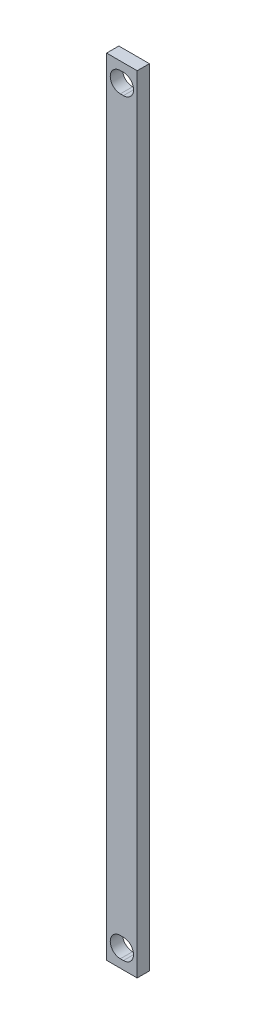
ISO-10303-21;
HEADER;
FILE_DESCRIPTION(('STEP AP214'),'2;1');
FILE_NAME('part.step','',(''),(''),'','','');
FILE_SCHEMA(('AUTOMOTIVE_DESIGN { 1 0 10303 214 1 1 1 1 }'));
ENDSEC;
DATA;
#1=APPLICATION_CONTEXT('core data for automotive mechanical design processes');
#2=APPLICATION_PROTOCOL_DEFINITION('international standard','automotive_design',2000,#1);
#3=PRODUCT_CONTEXT('',#1,'mechanical');
#4=PRODUCT('Part','Part','',(#3));
#5=PRODUCT_RELATED_PRODUCT_CATEGORY('part','',(#4));
#6=PRODUCT_DEFINITION_FORMATION('','',#4);
#7=PRODUCT_DEFINITION_CONTEXT('part definition',#1,'design');
#8=PRODUCT_DEFINITION('design','',#6,#7);
#9=PRODUCT_DEFINITION_SHAPE('','',#8);
#10=(LENGTH_UNIT() NAMED_UNIT(*) SI_UNIT(.MILLI.,.METRE.));
#11=(NAMED_UNIT(*) PLANE_ANGLE_UNIT() SI_UNIT($,.RADIAN.));
#12=(NAMED_UNIT(*) SI_UNIT($,.STERADIAN.) SOLID_ANGLE_UNIT());
#13=UNCERTAINTY_MEASURE_WITH_UNIT(LENGTH_MEASURE(1.E-05),#10,'distance_accuracy_value','');
#14=(GEOMETRIC_REPRESENTATION_CONTEXT(3) GLOBAL_UNCERTAINTY_ASSIGNED_CONTEXT((#13)) GLOBAL_UNIT_ASSIGNED_CONTEXT((#10,
#11,#12)) REPRESENTATION_CONTEXT('',''));
#15=CARTESIAN_POINT('',(0.,0.,0.));
#16=DIRECTION('',(0.,0.,1.));
#17=DIRECTION('',(1.,0.,0.));
#18=AXIS2_PLACEMENT_3D('',#15,#16,#17);
#19=CARTESIAN_POINT('',(0.,0.,2.));
#20=DIRECTION('',(0.,0.,1.));
#21=DIRECTION('',(1.,0.,0.));
#22=AXIS2_PLACEMENT_3D('',#19,#20,#21);
#23=PLANE('',#22);
#24=DIRECTION('',(0.,1.,0.));
#25=VECTOR('',#24,1.);
#26=CARTESIAN_POINT('',(2.49999999999999,64.25,2.));
#27=LINE('',#26,#25);
#28=CARTESIAN_POINT('',(2.50000000000001,-64.25,2.));
#29=VERTEX_POINT('',#28);
#30=CARTESIAN_POINT('',(2.49999999999999,64.25,2.));
#31=VERTEX_POINT('',#30);
#32=EDGE_CURVE('E199',#29,#31,#27,.T.);
#33=ORIENTED_EDGE('',*,*,#32,.T.);
#34=DIRECTION('',(-1.,0.,0.));
#35=VECTOR('',#34,1.);
#36=CARTESIAN_POINT('',(-2.50000000000001,64.25,2.));
#37=LINE('',#36,#35);
#38=CARTESIAN_POINT('',(-2.50000000000001,64.25,2.));
#39=VERTEX_POINT('',#38);
#40=EDGE_CURVE('E202',#31,#39,#37,.T.);
#41=ORIENTED_EDGE('',*,*,#40,.T.);
#42=DIRECTION('',(0.,-1.,0.));
#43=VECTOR('',#42,1.);
#44=CARTESIAN_POINT('',(-2.50000000000001,64.25,2.));
#45=LINE('',#44,#43);
#46=CARTESIAN_POINT('',(-2.49999999999999,-64.25,2.));
#47=VERTEX_POINT('',#46);
#48=EDGE_CURVE('E205',#39,#47,#45,.T.);
#49=ORIENTED_EDGE('',*,*,#48,.T.);
#50=DIRECTION('',(1.,0.,0.));
#51=VECTOR('',#50,1.);
#52=CARTESIAN_POINT('',(-2.49999999999999,-64.25,2.));
#53=LINE('',#52,#51);
#54=EDGE_CURVE('E207',#47,#29,#53,.T.);
#55=ORIENTED_EDGE('',*,*,#54,.T.);
#56=EDGE_LOOP('',(#33,#41,#49,#55));
#57=FACE_BOUND('',#56,.T.);
#58=DIRECTION('',(1.,0.,0.));
#59=VECTOR('',#58,1.);
#60=CARTESIAN_POINT('',(-0.253999999999985,-62.9,2.));
#61=LINE('',#60,#59);
#62=CARTESIAN_POINT('',(-0.253999999999985,-62.9,2.));
#63=VERTEX_POINT('',#62);
#64=CARTESIAN_POINT('',(0.254000000000016,-62.9,2.));
#65=VERTEX_POINT('',#64);
#66=EDGE_CURVE('E170',#63,#65,#61,.T.);
#67=ORIENTED_EDGE('',*,*,#66,.F.);
#68=CARTESIAN_POINT('',(-0.253999999999984,-61.25,2.));
#69=DIRECTION('',(0.,0.,1.));
#70=DIRECTION('',(1.,0.,0.));
#71=AXIS2_PLACEMENT_3D('',#68,#69,#70);
#72=CIRCLE('',#71,1.65);
#73=CARTESIAN_POINT('',(-0.253999999999985,-59.6,2.));
#74=VERTEX_POINT('',#73);
#75=EDGE_CURVE('E168',#74,#63,#72,.T.);
#76=ORIENTED_EDGE('',*,*,#75,.F.);
#77=DIRECTION('',(-1.,0.,0.));
#78=VECTOR('',#77,1.);
#79=CARTESIAN_POINT('',(-0.253999999999985,-59.6,2.));
#80=LINE('',#79,#78);
#81=CARTESIAN_POINT('',(0.254000000000015,-59.6,2.));
#82=VERTEX_POINT('',#81);
#83=EDGE_CURVE('E176',#82,#74,#80,.T.);
#84=ORIENTED_EDGE('',*,*,#83,.F.);
#85=CARTESIAN_POINT('',(0.254000000000015,-61.25,2.));
#86=DIRECTION('',(0.,0.,1.));
#87=DIRECTION('',(1.,0.,0.));
#88=AXIS2_PLACEMENT_3D('',#85,#86,#87);
#89=CIRCLE('',#88,1.65);
#90=EDGE_CURVE('E173',#65,#82,#89,.T.);
#91=ORIENTED_EDGE('',*,*,#90,.F.);
#92=EDGE_LOOP('',(#67,#76,#84,#91));
#93=FACE_BOUND('',#92,.T.);
#94=DIRECTION('',(1.,0.,0.));
#95=VECTOR('',#94,1.);
#96=CARTESIAN_POINT('',(-0.253999999999999,59.6,2.));
#97=LINE('',#96,#95);
#98=CARTESIAN_POINT('',(-0.253999999999999,59.6,2.));
#99=VERTEX_POINT('',#98);
#100=CARTESIAN_POINT('',(0.254,59.6,2.));
#101=VERTEX_POINT('',#100);
#102=EDGE_CURVE('E140',#99,#101,#97,.T.);
#103=ORIENTED_EDGE('',*,*,#102,.F.);
#104=CARTESIAN_POINT('',(-0.254,61.25,2.));
#105=DIRECTION('',(0.,0.,1.));
#106=DIRECTION('',(1.,0.,0.));
#107=AXIS2_PLACEMENT_3D('',#104,#105,#106);
#108=CIRCLE('',#107,1.65);
#109=CARTESIAN_POINT('',(-0.254,62.9,2.));
#110=VERTEX_POINT('',#109);
#111=EDGE_CURVE('E132',#110,#99,#108,.T.);
#112=ORIENTED_EDGE('',*,*,#111,.F.);
#113=DIRECTION('',(-1.,0.,0.));
#114=VECTOR('',#113,1.);
#115=CARTESIAN_POINT('',(-0.254,62.9,2.));
#116=LINE('',#115,#114);
#117=CARTESIAN_POINT('',(0.254,62.9,2.));
#118=VERTEX_POINT('',#117);
#119=EDGE_CURVE('E154',#118,#110,#116,.T.);
#120=ORIENTED_EDGE('',*,*,#119,.F.);
#121=CARTESIAN_POINT('',(0.254,61.25,2.));
#122=DIRECTION('',(0.,0.,1.));
#123=DIRECTION('',(1.,0.,0.));
#124=AXIS2_PLACEMENT_3D('',#121,#122,#123);
#125=CIRCLE('',#124,1.65);
#126=EDGE_CURVE('E152',#101,#118,#125,.T.);
#127=ORIENTED_EDGE('',*,*,#126,.F.);
#128=EDGE_LOOP('',(#103,#112,#120,#127));
#129=FACE_BOUND('',#128,.T.);
#130=ADVANCED_FACE('F43',(#57,#93,#129),#23,.T.);
#131=CARTESIAN_POINT('',(0.,0.,0.));
#132=DIRECTION('',(0.,0.,1.));
#133=DIRECTION('',(1.,0.,0.));
#134=AXIS2_PLACEMENT_3D('',#131,#132,#133);
#135=PLANE('',#134);
#136=CARTESIAN_POINT('',(-0.253999999999984,-61.25,0.));
#137=DIRECTION('',(0.,0.,1.));
#138=DIRECTION('',(1.,0.,0.));
#139=AXIS2_PLACEMENT_3D('',#136,#137,#138);
#140=CIRCLE('',#139,1.65);
#141=CARTESIAN_POINT('',(-0.253999999999985,-59.6,0.));
#142=VERTEX_POINT('',#141);
#143=CARTESIAN_POINT('',(-0.253999999999985,-62.9,0.));
#144=VERTEX_POINT('',#143);
#145=EDGE_CURVE('E148',#142,#144,#140,.T.);
#146=ORIENTED_EDGE('',*,*,#145,.T.);
#147=DIRECTION('',(1.,0.,0.));
#148=VECTOR('',#147,1.);
#149=CARTESIAN_POINT('',(-0.253999999999985,-62.9,0.));
#150=LINE('',#149,#148);
#151=CARTESIAN_POINT('',(0.254000000000016,-62.9,0.));
#152=VERTEX_POINT('',#151);
#153=EDGE_CURVE('E181',#144,#152,#150,.T.);
#154=ORIENTED_EDGE('',*,*,#153,.T.);
#155=CARTESIAN_POINT('',(0.254000000000015,-61.25,0.));
#156=DIRECTION('',(0.,0.,1.));
#157=DIRECTION('',(1.,0.,0.));
#158=AXIS2_PLACEMENT_3D('',#155,#156,#157);
#159=CIRCLE('',#158,1.65);
#160=CARTESIAN_POINT('',(0.254000000000015,-59.6,0.));
#161=VERTEX_POINT('',#160);
#162=EDGE_CURVE('E184',#152,#161,#159,.T.);
#163=ORIENTED_EDGE('',*,*,#162,.T.);
#164=DIRECTION('',(-1.,0.,0.));
#165=VECTOR('',#164,1.);
#166=CARTESIAN_POINT('',(-0.253999999999985,-59.6,0.));
#167=LINE('',#166,#165);
#168=EDGE_CURVE('E171',#161,#142,#167,.T.);
#169=ORIENTED_EDGE('',*,*,#168,.T.);
#170=EDGE_LOOP('',(#146,#154,#163,#169));
#171=FACE_BOUND('',#170,.T.);
#172=DIRECTION('',(0.,1.,0.));
#173=VECTOR('',#172,1.);
#174=CARTESIAN_POINT('',(2.49999999999999,64.25,0.));
#175=LINE('',#174,#173);
#176=CARTESIAN_POINT('',(2.50000000000001,-64.25,0.));
#177=VERTEX_POINT('',#176);
#178=CARTESIAN_POINT('',(2.49999999999999,64.25,0.));
#179=VERTEX_POINT('',#178);
#180=EDGE_CURVE('E198',#177,#179,#175,.T.);
#181=ORIENTED_EDGE('',*,*,#180,.F.);
#182=DIRECTION('',(1.,0.,0.));
#183=VECTOR('',#182,1.);
#184=CARTESIAN_POINT('',(-2.49999999999999,-64.25,0.));
#185=LINE('',#184,#183);
#186=CARTESIAN_POINT('',(-2.49999999999999,-64.25,0.));
#187=VERTEX_POINT('',#186);
#188=EDGE_CURVE('E203',#187,#177,#185,.T.);
#189=ORIENTED_EDGE('',*,*,#188,.F.);
#190=DIRECTION('',(0.,-1.,0.));
#191=VECTOR('',#190,1.);
#192=CARTESIAN_POINT('',(-2.50000000000001,64.25,0.));
#193=LINE('',#192,#191);
#194=CARTESIAN_POINT('',(-2.50000000000001,64.25,0.));
#195=VERTEX_POINT('',#194);
#196=EDGE_CURVE('E214',#195,#187,#193,.T.);
#197=ORIENTED_EDGE('',*,*,#196,.F.);
#198=DIRECTION('',(-1.,0.,0.));
#199=VECTOR('',#198,1.);
#200=CARTESIAN_POINT('',(-2.50000000000001,64.25,0.));
#201=LINE('',#200,#199);
#202=EDGE_CURVE('E212',#179,#195,#201,.T.);
#203=ORIENTED_EDGE('',*,*,#202,.F.);
#204=EDGE_LOOP('',(#181,#189,#197,#203));
#205=FACE_BOUND('',#204,.T.);
#206=CARTESIAN_POINT('',(-0.254,61.25,0.));
#207=DIRECTION('',(0.,0.,1.));
#208=DIRECTION('',(1.,0.,0.));
#209=AXIS2_PLACEMENT_3D('',#206,#207,#208);
#210=CIRCLE('',#209,1.65);
#211=CARTESIAN_POINT('',(-0.254,62.9,0.));
#212=VERTEX_POINT('',#211);
#213=CARTESIAN_POINT('',(-0.253999999999999,59.6,0.));
#214=VERTEX_POINT('',#213);
#215=EDGE_CURVE('E66',#212,#214,#210,.T.);
#216=ORIENTED_EDGE('',*,*,#215,.T.);
#217=DIRECTION('',(1.,0.,0.));
#218=VECTOR('',#217,1.);
#219=CARTESIAN_POINT('',(-0.253999999999999,59.6,0.));
#220=LINE('',#219,#218);
#221=CARTESIAN_POINT('',(0.254,59.6,0.));
#222=VERTEX_POINT('',#221);
#223=EDGE_CURVE('E147',#214,#222,#220,.T.);
#224=ORIENTED_EDGE('',*,*,#223,.T.);
#225=CARTESIAN_POINT('',(0.254,61.25,0.));
#226=DIRECTION('',(0.,0.,1.));
#227=DIRECTION('',(1.,0.,0.));
#228=AXIS2_PLACEMENT_3D('',#225,#226,#227);
#229=CIRCLE('',#228,1.65);
#230=CARTESIAN_POINT('',(0.254,62.9,0.));
#231=VERTEX_POINT('',#230);
#232=EDGE_CURVE('E160',#222,#231,#229,.T.);
#233=ORIENTED_EDGE('',*,*,#232,.T.);
#234=DIRECTION('',(-1.,0.,0.));
#235=VECTOR('',#234,1.);
#236=CARTESIAN_POINT('',(-0.254,62.9,0.));
#237=LINE('',#236,#235);
#238=EDGE_CURVE('E141',#231,#212,#237,.T.);
#239=ORIENTED_EDGE('',*,*,#238,.T.);
#240=EDGE_LOOP('',(#216,#224,#233,#239));
#241=FACE_BOUND('',#240,.T.);
#242=ADVANCED_FACE('F232',(#171,#205,#241),#135,.F.);
#243=CARTESIAN_POINT('',(2.49999999999999,64.25,2.));
#244=DIRECTION('',(-1.,0.,0.));
#245=DIRECTION('',(0.,-1.,0.));
#246=AXIS2_PLACEMENT_3D('',#243,#244,#245);
#247=PLANE('',#246);
#248=ORIENTED_EDGE('',*,*,#180,.T.);
#249=DIRECTION('',(0.,0.,-1.));
#250=VECTOR('',#249,1.);
#251=CARTESIAN_POINT('',(2.49999999999999,64.25,2.));
#252=LINE('',#251,#250);
#253=EDGE_CURVE('E11',#31,#179,#252,.T.);
#254=ORIENTED_EDGE('',*,*,#253,.F.);
#255=ORIENTED_EDGE('',*,*,#32,.F.);
#256=DIRECTION('',(0.,0.,-1.));
#257=VECTOR('',#256,1.);
#258=CARTESIAN_POINT('',(2.50000000000001,-64.25,2.));
#259=LINE('',#258,#257);
#260=EDGE_CURVE('E209',#29,#177,#259,.T.);
#261=ORIENTED_EDGE('',*,*,#260,.T.);
#262=EDGE_LOOP('',(#248,#254,#255,#261));
#263=FACE_BOUND('',#262,.T.);
#264=ADVANCED_FACE('F45',(#263),#247,.F.);
#265=CARTESIAN_POINT('',(-2.50000000000001,64.25,2.));
#266=DIRECTION('',(0.,-1.,0.));
#267=DIRECTION('',(0.,0.,-1.));
#268=AXIS2_PLACEMENT_3D('',#265,#266,#267);
#269=PLANE('',#268);
#270=ORIENTED_EDGE('',*,*,#202,.T.);
#271=DIRECTION('',(0.,0.,-1.));
#272=VECTOR('',#271,1.);
#273=CARTESIAN_POINT('',(-2.50000000000001,64.25,2.));
#274=LINE('',#273,#272);
#275=EDGE_CURVE('E51',#39,#195,#274,.T.);
#276=ORIENTED_EDGE('',*,*,#275,.F.);
#277=ORIENTED_EDGE('',*,*,#40,.F.);
#278=ORIENTED_EDGE('',*,*,#253,.T.);
#279=EDGE_LOOP('',(#270,#276,#277,#278));
#280=FACE_BOUND('',#279,.T.);
#281=ADVANCED_FACE('F243',(#280),#269,.F.);
#282=CARTESIAN_POINT('',(-2.50000000000001,64.25,2.));
#283=DIRECTION('',(1.,0.,0.));
#284=DIRECTION('',(0.,1.,0.));
#285=AXIS2_PLACEMENT_3D('',#282,#283,#284);
#286=PLANE('',#285);
#287=ORIENTED_EDGE('',*,*,#196,.T.);
#288=DIRECTION('',(0.,0.,-1.));
#289=VECTOR('',#288,1.);
#290=CARTESIAN_POINT('',(-2.49999999999999,-64.25,2.));
#291=LINE('',#290,#289);
#292=EDGE_CURVE('E219',#47,#187,#291,.T.);
#293=ORIENTED_EDGE('',*,*,#292,.F.);
#294=ORIENTED_EDGE('',*,*,#48,.F.);
#295=ORIENTED_EDGE('',*,*,#275,.T.);
#296=EDGE_LOOP('',(#287,#293,#294,#295));
#297=FACE_BOUND('',#296,.T.);
#298=ADVANCED_FACE('F226',(#297),#286,.F.);
#299=CARTESIAN_POINT('',(-2.49999999999999,-64.25,2.));
#300=DIRECTION('',(0.,1.,0.));
#301=DIRECTION('',(0.,0.,1.));
#302=AXIS2_PLACEMENT_3D('',#299,#300,#301);
#303=PLANE('',#302);
#304=ORIENTED_EDGE('',*,*,#188,.T.);
#305=ORIENTED_EDGE('',*,*,#260,.F.);
#306=ORIENTED_EDGE('',*,*,#54,.F.);
#307=ORIENTED_EDGE('',*,*,#292,.T.);
#308=EDGE_LOOP('',(#304,#305,#306,#307));
#309=FACE_BOUND('',#308,.T.);
#310=ADVANCED_FACE('F236',(#309),#303,.F.);
#311=CARTESIAN_POINT('',(-0.253999999999984,-61.25,2.));
#312=DIRECTION('',(0.,0.,-1.));
#313=DIRECTION('',(-1.,0.,0.));
#314=AXIS2_PLACEMENT_3D('',#311,#312,#313);
#315=CYLINDRICAL_SURFACE('',#314,1.65);
#316=ORIENTED_EDGE('',*,*,#145,.F.);
#317=DIRECTION('',(0.,0.,-1.));
#318=VECTOR('',#317,1.);
#319=CARTESIAN_POINT('',(-0.253999999999985,-59.6,2.));
#320=LINE('',#319,#318);
#321=EDGE_CURVE('E178',#74,#142,#320,.T.);
#322=ORIENTED_EDGE('',*,*,#321,.F.);
#323=ORIENTED_EDGE('',*,*,#75,.T.);
#324=DIRECTION('',(0.,0.,-1.));
#325=VECTOR('',#324,1.);
#326=CARTESIAN_POINT('',(-0.253999999999985,-62.9,2.));
#327=LINE('',#326,#325);
#328=EDGE_CURVE('E195',#63,#144,#327,.T.);
#329=ORIENTED_EDGE('',*,*,#328,.T.);
#330=EDGE_LOOP('',(#316,#322,#323,#329));
#331=FACE_BOUND('',#330,.T.);
#332=ADVANCED_FACE('F258',(#331),#315,.F.);
#333=CARTESIAN_POINT('',(-0.253999999999985,-62.9,2.));
#334=DIRECTION('',(0.,1.,0.));
#335=DIRECTION('',(0.,0.,1.));
#336=AXIS2_PLACEMENT_3D('',#333,#334,#335);
#337=PLANE('',#336);
#338=ORIENTED_EDGE('',*,*,#153,.F.);
#339=ORIENTED_EDGE('',*,*,#328,.F.);
#340=ORIENTED_EDGE('',*,*,#66,.T.);
#341=DIRECTION('',(0.,0.,-1.));
#342=VECTOR('',#341,1.);
#343=CARTESIAN_POINT('',(0.254000000000016,-62.9,2.));
#344=LINE('',#343,#342);
#345=EDGE_CURVE('E193',#65,#152,#344,.T.);
#346=ORIENTED_EDGE('',*,*,#345,.T.);
#347=EDGE_LOOP('',(#338,#339,#340,#346));
#348=FACE_BOUND('',#347,.T.);
#349=ADVANCED_FACE('F265',(#348),#337,.T.);
#350=CARTESIAN_POINT('',(0.254000000000015,-61.25,2.));
#351=DIRECTION('',(0.,0.,-1.));
#352=DIRECTION('',(-1.,0.,0.));
#353=AXIS2_PLACEMENT_3D('',#350,#351,#352);
#354=CYLINDRICAL_SURFACE('',#353,1.65);
#355=ORIENTED_EDGE('',*,*,#162,.F.);
#356=ORIENTED_EDGE('',*,*,#345,.F.);
#357=ORIENTED_EDGE('',*,*,#90,.T.);
#358=DIRECTION('',(0.,0.,-1.));
#359=VECTOR('',#358,1.);
#360=CARTESIAN_POINT('',(0.254000000000015,-59.6,2.));
#361=LINE('',#360,#359);
#362=EDGE_CURVE('E191',#82,#161,#361,.T.);
#363=ORIENTED_EDGE('',*,*,#362,.T.);
#364=EDGE_LOOP('',(#355,#356,#357,#363));
#365=FACE_BOUND('',#364,.T.);
#366=ADVANCED_FACE('F270',(#365),#354,.F.);
#367=CARTESIAN_POINT('',(-0.253999999999985,-59.6,2.));
#368=DIRECTION('',(0.,-1.,0.));
#369=DIRECTION('',(0.,0.,-1.));
#370=AXIS2_PLACEMENT_3D('',#367,#368,#369);
#371=PLANE('',#370);
#372=ORIENTED_EDGE('',*,*,#168,.F.);
#373=ORIENTED_EDGE('',*,*,#362,.F.);
#374=ORIENTED_EDGE('',*,*,#83,.T.);
#375=ORIENTED_EDGE('',*,*,#321,.T.);
#376=EDGE_LOOP('',(#372,#373,#374,#375));
#377=FACE_BOUND('',#376,.T.);
#378=ADVANCED_FACE('F277',(#377),#371,.T.);
#379=CARTESIAN_POINT('',(-0.254,61.25,2.));
#380=DIRECTION('',(0.,0.,-1.));
#381=DIRECTION('',(-1.,0.,0.));
#382=AXIS2_PLACEMENT_3D('',#379,#380,#381);
#383=CYLINDRICAL_SURFACE('',#382,1.65);
#384=ORIENTED_EDGE('',*,*,#215,.F.);
#385=DIRECTION('',(0.,0.,-1.));
#386=VECTOR('',#385,1.);
#387=CARTESIAN_POINT('',(-0.254,62.9,2.));
#388=LINE('',#387,#386);
#389=EDGE_CURVE('E136',#110,#212,#388,.T.);
#390=ORIENTED_EDGE('',*,*,#389,.F.);
#391=ORIENTED_EDGE('',*,*,#111,.T.);
#392=DIRECTION('',(0.,0.,-1.));
#393=VECTOR('',#392,1.);
#394=CARTESIAN_POINT('',(-0.253999999999999,59.6,2.));
#395=LINE('',#394,#393);
#396=EDGE_CURVE('E135',#99,#214,#395,.T.);
#397=ORIENTED_EDGE('',*,*,#396,.T.);
#398=EDGE_LOOP('',(#384,#390,#391,#397));
#399=FACE_BOUND('',#398,.T.);
#400=ADVANCED_FACE('F134',(#399),#383,.F.);
#401=CARTESIAN_POINT('',(-0.253999999999999,59.6,2.));
#402=DIRECTION('',(0.,1.,0.));
#403=DIRECTION('',(0.,0.,1.));
#404=AXIS2_PLACEMENT_3D('',#401,#402,#403);
#405=PLANE('',#404);
#406=ORIENTED_EDGE('',*,*,#223,.F.);
#407=ORIENTED_EDGE('',*,*,#396,.F.);
#408=ORIENTED_EDGE('',*,*,#102,.T.);
#409=DIRECTION('',(0.,0.,-1.));
#410=VECTOR('',#409,1.);
#411=CARTESIAN_POINT('',(0.254,59.6,2.));
#412=LINE('',#411,#410);
#413=EDGE_CURVE('E149',#101,#222,#412,.T.);
#414=ORIENTED_EDGE('',*,*,#413,.T.);
#415=EDGE_LOOP('',(#406,#407,#408,#414));
#416=FACE_BOUND('',#415,.T.);
#417=ADVANCED_FACE('F144',(#416),#405,.T.);
#418=CARTESIAN_POINT('',(0.254,61.25,2.));
#419=DIRECTION('',(0.,0.,-1.));
#420=DIRECTION('',(-1.,0.,0.));
#421=AXIS2_PLACEMENT_3D('',#418,#419,#420);
#422=CYLINDRICAL_SURFACE('',#421,1.65);
#423=ORIENTED_EDGE('',*,*,#232,.F.);
#424=ORIENTED_EDGE('',*,*,#413,.F.);
#425=ORIENTED_EDGE('',*,*,#126,.T.);
#426=DIRECTION('',(0.,0.,-1.));
#427=VECTOR('',#426,1.);
#428=CARTESIAN_POINT('',(0.254,62.9,2.));
#429=LINE('',#428,#427);
#430=EDGE_CURVE('E58',#118,#231,#429,.T.);
#431=ORIENTED_EDGE('',*,*,#430,.T.);
#432=EDGE_LOOP('',(#423,#424,#425,#431));
#433=FACE_BOUND('',#432,.T.);
#434=ADVANCED_FACE('F295',(#433),#422,.F.);
#435=CARTESIAN_POINT('',(-0.254,62.9,2.));
#436=DIRECTION('',(0.,-1.,0.));
#437=DIRECTION('',(0.,0.,-1.));
#438=AXIS2_PLACEMENT_3D('',#435,#436,#437);
#439=PLANE('',#438);
#440=ORIENTED_EDGE('',*,*,#238,.F.);
#441=ORIENTED_EDGE('',*,*,#430,.F.);
#442=ORIENTED_EDGE('',*,*,#119,.T.);
#443=ORIENTED_EDGE('',*,*,#389,.T.);
#444=EDGE_LOOP('',(#440,#441,#442,#443));
#445=FACE_BOUND('',#444,.T.);
#446=ADVANCED_FACE('F298',(#445),#439,.T.);
#447=CLOSED_SHELL('',(#130,#242,#264,#281,#298,#310,#332,#349,#366,#378,#400,#417,#434,#446));
#448=MANIFOLD_SOLID_BREP('B2',#447);
#449=ADVANCED_BREP_SHAPE_REPRESENTATION('',(#18,#448),#14);
#450=SHAPE_DEFINITION_REPRESENTATION(#9,#449);
ENDSEC;
END-ISO-10303-21;
